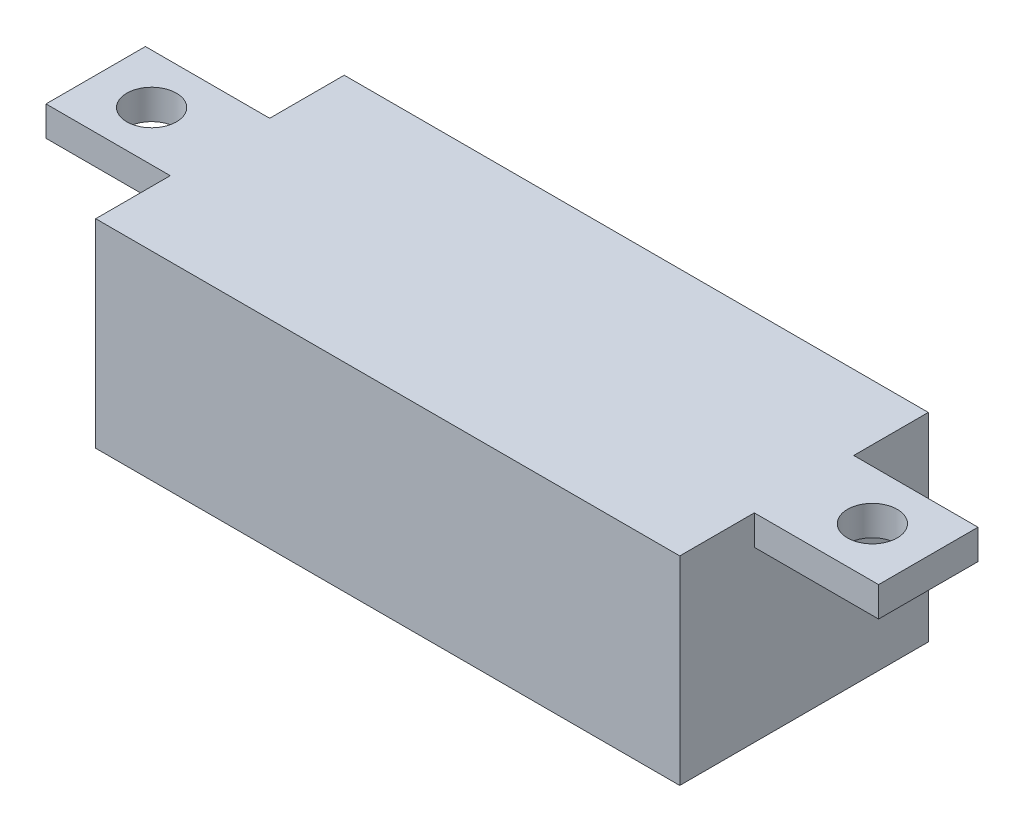
ISO-10303-21;
HEADER;
FILE_DESCRIPTION(('STEP AP214'),'2;1');
FILE_NAME('part.step','',(''),(''),'','','');
FILE_SCHEMA(('AUTOMOTIVE_DESIGN { 1 0 10303 214 1 1 1 1 }'));
ENDSEC;
DATA;
#1=APPLICATION_CONTEXT('core data for automotive mechanical design processes');
#2=APPLICATION_PROTOCOL_DEFINITION('international standard','automotive_design',2000,#1);
#3=PRODUCT_CONTEXT('',#1,'mechanical');
#4=PRODUCT('Part','Part','',(#3));
#5=PRODUCT_RELATED_PRODUCT_CATEGORY('part','',(#4));
#6=PRODUCT_DEFINITION_FORMATION('','',#4);
#7=PRODUCT_DEFINITION_CONTEXT('part definition',#1,'design');
#8=PRODUCT_DEFINITION('design','',#6,#7);
#9=PRODUCT_DEFINITION_SHAPE('','',#8);
#10=(LENGTH_UNIT() NAMED_UNIT(*) SI_UNIT(.MILLI.,.METRE.));
#11=(NAMED_UNIT(*) PLANE_ANGLE_UNIT() SI_UNIT($,.RADIAN.));
#12=(NAMED_UNIT(*) SI_UNIT($,.STERADIAN.) SOLID_ANGLE_UNIT());
#13=UNCERTAINTY_MEASURE_WITH_UNIT(LENGTH_MEASURE(1.E-05),#10,'distance_accuracy_value','');
#14=(GEOMETRIC_REPRESENTATION_CONTEXT(3) GLOBAL_UNCERTAINTY_ASSIGNED_CONTEXT((#13)) GLOBAL_UNIT_ASSIGNED_CONTEXT((#10,
#11,#12)) REPRESENTATION_CONTEXT('',''));
#15=CARTESIAN_POINT('',(0.,0.,0.));
#16=DIRECTION('',(0.,0.,1.));
#17=DIRECTION('',(1.,0.,0.));
#18=AXIS2_PLACEMENT_3D('',#15,#16,#17);
#19=CARTESIAN_POINT('',(-11.75,8.,5.));
#20=DIRECTION('',(1.,0.,0.));
#21=DIRECTION('',(0.,0.,-1.));
#22=AXIS2_PLACEMENT_3D('',#19,#20,#21);
#23=PLANE('',#22);
#24=DIRECTION('',(0.,0.,-1.));
#25=VECTOR('',#24,1.);
#26=CARTESIAN_POINT('',(-11.75,6.8,5.));
#27=LINE('',#26,#25);
#28=CARTESIAN_POINT('',(-11.75,6.8,2.));
#29=VERTEX_POINT('',#28);
#30=CARTESIAN_POINT('',(-11.75,6.8,-2.));
#31=VERTEX_POINT('',#30);
#32=EDGE_CURVE('E11',#29,#31,#27,.T.);
#33=ORIENTED_EDGE('',*,*,#32,.T.);
#34=DIRECTION('',(0.,1.,0.));
#35=VECTOR('',#34,1.);
#36=CARTESIAN_POINT('',(-11.75,8.,-2.));
#37=LINE('',#36,#35);
#38=CARTESIAN_POINT('',(-11.75,8.,-2.));
#39=VERTEX_POINT('',#38);
#40=EDGE_CURVE('E156',#31,#39,#37,.T.);
#41=ORIENTED_EDGE('',*,*,#40,.T.);
#42=DIRECTION('',(0.,0.,1.));
#43=VECTOR('',#42,1.);
#44=CARTESIAN_POINT('',(-11.75,8.,5.));
#45=LINE('',#44,#43);
#46=CARTESIAN_POINT('',(-11.75,8.,-5.));
#47=VERTEX_POINT('',#46);
#48=EDGE_CURVE('E190',#47,#39,#45,.T.);
#49=ORIENTED_EDGE('',*,*,#48,.F.);
#50=DIRECTION('',(0.,-1.,0.));
#51=VECTOR('',#50,1.);
#52=CARTESIAN_POINT('',(-11.75,8.,-5.));
#53=LINE('',#52,#51);
#54=CARTESIAN_POINT('',(-11.75,0.,-5.));
#55=VERTEX_POINT('',#54);
#56=EDGE_CURVE('E202',#47,#55,#53,.T.);
#57=ORIENTED_EDGE('',*,*,#56,.T.);
#58=DIRECTION('',(0.,0.,1.));
#59=VECTOR('',#58,1.);
#60=CARTESIAN_POINT('',(-11.75,0.,5.));
#61=LINE('',#60,#59);
#62=CARTESIAN_POINT('',(-11.75,0.,5.));
#63=VERTEX_POINT('',#62);
#64=EDGE_CURVE('E189',#55,#63,#61,.T.);
#65=ORIENTED_EDGE('',*,*,#64,.T.);
#66=DIRECTION('',(0.,-1.,0.));
#67=VECTOR('',#66,1.);
#68=CARTESIAN_POINT('',(-11.75,8.,5.));
#69=LINE('',#68,#67);
#70=CARTESIAN_POINT('',(-11.75,8.,5.));
#71=VERTEX_POINT('',#70);
#72=EDGE_CURVE('E219',#71,#63,#69,.T.);
#73=ORIENTED_EDGE('',*,*,#72,.F.);
#74=CARTESIAN_POINT('',(-11.75,8.,2.));
#75=VERTEX_POINT('',#74);
#76=EDGE_CURVE('E194',#75,#71,#45,.T.);
#77=ORIENTED_EDGE('',*,*,#76,.F.);
#78=DIRECTION('',(0.,-1.,0.));
#79=VECTOR('',#78,1.);
#80=CARTESIAN_POINT('',(-11.75,8.,2.));
#81=LINE('',#80,#79);
#82=EDGE_CURVE('E153',#75,#29,#81,.T.);
#83=ORIENTED_EDGE('',*,*,#82,.T.);
#84=EDGE_LOOP('',(#33,#41,#49,#57,#65,#73,#77,#83));
#85=FACE_BOUND('',#84,.T.);
#86=ADVANCED_FACE('F33',(#85),#23,.F.);
#87=CARTESIAN_POINT('',(11.75,8.,5.));
#88=DIRECTION('',(0.,0.,-1.));
#89=DIRECTION('',(-1.,0.,0.));
#90=AXIS2_PLACEMENT_3D('',#87,#88,#89);
#91=PLANE('',#90);
#92=DIRECTION('',(1.,0.,0.));
#93=VECTOR('',#92,1.);
#94=CARTESIAN_POINT('',(11.75,0.,5.));
#95=LINE('',#94,#93);
#96=CARTESIAN_POINT('',(11.75,0.,5.));
#97=VERTEX_POINT('',#96);
#98=EDGE_CURVE('E205',#63,#97,#95,.T.);
#99=ORIENTED_EDGE('',*,*,#98,.T.);
#100=DIRECTION('',(0.,-1.,0.));
#101=VECTOR('',#100,1.);
#102=CARTESIAN_POINT('',(11.75,8.,5.));
#103=LINE('',#102,#101);
#104=CARTESIAN_POINT('',(11.75,8.,5.));
#105=VERTEX_POINT('',#104);
#106=EDGE_CURVE('E216',#105,#97,#103,.T.);
#107=ORIENTED_EDGE('',*,*,#106,.F.);
#108=DIRECTION('',(1.,0.,0.));
#109=VECTOR('',#108,1.);
#110=CARTESIAN_POINT('',(11.75,8.,5.));
#111=LINE('',#110,#109);
#112=EDGE_CURVE('E193',#71,#105,#111,.T.);
#113=ORIENTED_EDGE('',*,*,#112,.F.);
#114=ORIENTED_EDGE('',*,*,#72,.T.);
#115=EDGE_LOOP('',(#99,#107,#113,#114));
#116=FACE_BOUND('',#115,.T.);
#117=ADVANCED_FACE('F256',(#116),#91,.F.);
#118=CARTESIAN_POINT('',(11.75,8.,5.));
#119=DIRECTION('',(-1.,0.,0.));
#120=DIRECTION('',(0.,0.,1.));
#121=AXIS2_PLACEMENT_3D('',#118,#119,#120);
#122=PLANE('',#121);
#123=DIRECTION('',(0.,0.,-1.));
#124=VECTOR('',#123,1.);
#125=CARTESIAN_POINT('',(11.75,8.,5.));
#126=LINE('',#125,#124);
#127=CARTESIAN_POINT('',(11.75,8.,-2.));
#128=VERTEX_POINT('',#127);
#129=CARTESIAN_POINT('',(11.75,8.,-5.));
#130=VERTEX_POINT('',#129);
#131=EDGE_CURVE('E196',#128,#130,#126,.T.);
#132=ORIENTED_EDGE('',*,*,#131,.F.);
#133=DIRECTION('',(0.,-1.,0.));
#134=VECTOR('',#133,1.);
#135=CARTESIAN_POINT('',(11.75,8.,-2.));
#136=LINE('',#135,#134);
#137=CARTESIAN_POINT('',(11.75,6.8,-2.));
#138=VERTEX_POINT('',#137);
#139=EDGE_CURVE('E186',#128,#138,#136,.T.);
#140=ORIENTED_EDGE('',*,*,#139,.T.);
#141=DIRECTION('',(0.,0.,-1.));
#142=VECTOR('',#141,1.);
#143=CARTESIAN_POINT('',(11.75,6.8,5.));
#144=LINE('',#143,#142);
#145=CARTESIAN_POINT('',(11.75,6.8,2.));
#146=VERTEX_POINT('',#145);
#147=EDGE_CURVE('E40',#146,#138,#144,.T.);
#148=ORIENTED_EDGE('',*,*,#147,.F.);
#149=DIRECTION('',(0.,1.,0.));
#150=VECTOR('',#149,1.);
#151=CARTESIAN_POINT('',(11.75,8.,2.));
#152=LINE('',#151,#150);
#153=CARTESIAN_POINT('',(11.75,8.,2.));
#154=VERTEX_POINT('',#153);
#155=EDGE_CURVE('E181',#146,#154,#152,.T.);
#156=ORIENTED_EDGE('',*,*,#155,.T.);
#157=EDGE_CURVE('E197',#105,#154,#126,.T.);
#158=ORIENTED_EDGE('',*,*,#157,.F.);
#159=ORIENTED_EDGE('',*,*,#106,.T.);
#160=DIRECTION('',(0.,0.,-1.));
#161=VECTOR('',#160,1.);
#162=CARTESIAN_POINT('',(11.75,0.,5.));
#163=LINE('',#162,#161);
#164=CARTESIAN_POINT('',(11.75,0.,-5.));
#165=VERTEX_POINT('',#164);
#166=EDGE_CURVE('E207',#97,#165,#163,.T.);
#167=ORIENTED_EDGE('',*,*,#166,.T.);
#168=DIRECTION('',(0.,-1.,0.));
#169=VECTOR('',#168,1.);
#170=CARTESIAN_POINT('',(11.75,8.,-5.));
#171=LINE('',#170,#169);
#172=EDGE_CURVE('E213',#130,#165,#171,.T.);
#173=ORIENTED_EDGE('',*,*,#172,.F.);
#174=EDGE_LOOP('',(#132,#140,#148,#156,#158,#159,#167,#173));
#175=FACE_BOUND('',#174,.T.);
#176=ADVANCED_FACE('F231',(#175),#122,.F.);
#177=CARTESIAN_POINT('',(11.75,8.,-5.));
#178=DIRECTION('',(0.,0.,1.));
#179=DIRECTION('',(1.,0.,0.));
#180=AXIS2_PLACEMENT_3D('',#177,#178,#179);
#181=PLANE('',#180);
#182=DIRECTION('',(-1.,0.,0.));
#183=VECTOR('',#182,1.);
#184=CARTESIAN_POINT('',(11.75,0.,-5.));
#185=LINE('',#184,#183);
#186=EDGE_CURVE('E209',#165,#55,#185,.T.);
#187=ORIENTED_EDGE('',*,*,#186,.T.);
#188=ORIENTED_EDGE('',*,*,#56,.F.);
#189=DIRECTION('',(-1.,0.,0.));
#190=VECTOR('',#189,1.);
#191=CARTESIAN_POINT('',(11.75,8.,-5.));
#192=LINE('',#191,#190);
#193=EDGE_CURVE('E200',#130,#47,#192,.T.);
#194=ORIENTED_EDGE('',*,*,#193,.F.);
#195=ORIENTED_EDGE('',*,*,#172,.T.);
#196=EDGE_LOOP('',(#187,#188,#194,#195));
#197=FACE_BOUND('',#196,.T.);
#198=ADVANCED_FACE('F239',(#197),#181,.F.);
#199=CARTESIAN_POINT('',(0.,8.,0.));
#200=DIRECTION('',(0.,1.,0.));
#201=DIRECTION('',(0.,0.,1.));
#202=AXIS2_PLACEMENT_3D('',#199,#200,#201);
#203=PLANE('',#202);
#204=ORIENTED_EDGE('',*,*,#48,.T.);
#205=DIRECTION('',(-1.,0.,0.));
#206=VECTOR('',#205,1.);
#207=CARTESIAN_POINT('',(-16.75,8.,-2.));
#208=LINE('',#207,#206);
#209=CARTESIAN_POINT('',(-16.75,8.,-2.));
#210=VERTEX_POINT('',#209);
#211=EDGE_CURVE('E141',#39,#210,#208,.T.);
#212=ORIENTED_EDGE('',*,*,#211,.T.);
#213=DIRECTION('',(0.,0.,1.));
#214=VECTOR('',#213,1.);
#215=CARTESIAN_POINT('',(-16.75,8.,2.));
#216=LINE('',#215,#214);
#217=CARTESIAN_POINT('',(-16.75,8.,2.));
#218=VERTEX_POINT('',#217);
#219=EDGE_CURVE('E149',#210,#218,#216,.T.);
#220=ORIENTED_EDGE('',*,*,#219,.T.);
#221=DIRECTION('',(1.,0.,0.));
#222=VECTOR('',#221,1.);
#223=CARTESIAN_POINT('',(-16.75,8.,2.));
#224=LINE('',#223,#222);
#225=EDGE_CURVE('E47',#218,#75,#224,.T.);
#226=ORIENTED_EDGE('',*,*,#225,.T.);
#227=ORIENTED_EDGE('',*,*,#76,.T.);
#228=ORIENTED_EDGE('',*,*,#112,.T.);
#229=ORIENTED_EDGE('',*,*,#157,.T.);
#230=DIRECTION('',(1.,0.,0.));
#231=VECTOR('',#230,1.);
#232=CARTESIAN_POINT('',(16.75,8.,2.));
#233=LINE('',#232,#231);
#234=CARTESIAN_POINT('',(16.75,8.,2.));
#235=VERTEX_POINT('',#234);
#236=EDGE_CURVE('E163',#154,#235,#233,.T.);
#237=ORIENTED_EDGE('',*,*,#236,.T.);
#238=DIRECTION('',(0.,0.,-1.));
#239=VECTOR('',#238,1.);
#240=CARTESIAN_POINT('',(16.75,8.,2.));
#241=LINE('',#240,#239);
#242=CARTESIAN_POINT('',(16.75,8.,-2.));
#243=VERTEX_POINT('',#242);
#244=EDGE_CURVE('E176',#235,#243,#241,.T.);
#245=ORIENTED_EDGE('',*,*,#244,.T.);
#246=DIRECTION('',(-1.,0.,0.));
#247=VECTOR('',#246,1.);
#248=CARTESIAN_POINT('',(16.75,8.,-2.));
#249=LINE('',#248,#247);
#250=EDGE_CURVE('E54',#243,#128,#249,.T.);
#251=ORIENTED_EDGE('',*,*,#250,.T.);
#252=ORIENTED_EDGE('',*,*,#131,.T.);
#253=ORIENTED_EDGE('',*,*,#193,.T.);
#254=EDGE_LOOP('',(#204,#212,#220,#226,#227,#228,#229,#237,#245,#251,#252,#253));
#255=FACE_BOUND('',#254,.T.);
#256=CARTESIAN_POINT('',(14.5,8.,0.));
#257=DIRECTION('',(0.,1.,0.));
#258=DIRECTION('',(0.,0.,1.));
#259=AXIS2_PLACEMENT_3D('',#256,#257,#258);
#260=CIRCLE('',#259,1.);
#261=CARTESIAN_POINT('',(14.5,8.,1.));
#262=VERTEX_POINT('',#261);
#263=EDGE_CURVE('E159',#262,#262,#260,.T.);
#264=ORIENTED_EDGE('',*,*,#263,.F.);
#265=EDGE_LOOP('',(#264));
#266=FACE_BOUND('',#265,.T.);
#267=CARTESIAN_POINT('',(-14.5,8.,0.));
#268=DIRECTION('',(0.,1.,0.));
#269=DIRECTION('',(0.,0.,-1.));
#270=AXIS2_PLACEMENT_3D('',#267,#268,#269);
#271=CIRCLE('',#270,1.);
#272=CARTESIAN_POINT('',(-14.5,8.,-1.));
#273=VERTEX_POINT('',#272);
#274=EDGE_CURVE('E145',#273,#273,#271,.T.);
#275=ORIENTED_EDGE('',*,*,#274,.F.);
#276=EDGE_LOOP('',(#275));
#277=FACE_BOUND('',#276,.T.);
#278=ADVANCED_FACE('F234',(#255,#266,#277),#203,.T.);
#279=CARTESIAN_POINT('',(0.,0.,0.));
#280=DIRECTION('',(0.,1.,0.));
#281=DIRECTION('',(0.,0.,1.));
#282=AXIS2_PLACEMENT_3D('',#279,#280,#281);
#283=PLANE('',#282);
#284=ORIENTED_EDGE('',*,*,#64,.F.);
#285=ORIENTED_EDGE('',*,*,#186,.F.);
#286=ORIENTED_EDGE('',*,*,#166,.F.);
#287=ORIENTED_EDGE('',*,*,#98,.F.);
#288=EDGE_LOOP('',(#284,#285,#286,#287));
#289=FACE_BOUND('',#288,.T.);
#290=ADVANCED_FACE('F268',(#289),#283,.F.);
#291=CARTESIAN_POINT('',(0.,6.8,0.));
#292=DIRECTION('',(0.,1.,0.));
#293=DIRECTION('',(0.,0.,1.));
#294=AXIS2_PLACEMENT_3D('',#291,#292,#293);
#295=PLANE('',#294);
#296=CARTESIAN_POINT('',(14.5,6.8,0.));
#297=DIRECTION('',(0.,1.,0.));
#298=DIRECTION('',(0.,0.,1.));
#299=AXIS2_PLACEMENT_3D('',#296,#297,#298);
#300=CIRCLE('',#299,1.);
#301=CARTESIAN_POINT('',(14.5,6.8,1.));
#302=VERTEX_POINT('',#301);
#303=EDGE_CURVE('E160',#302,#302,#300,.T.);
#304=ORIENTED_EDGE('',*,*,#303,.T.);
#305=EDGE_LOOP('',(#304));
#306=FACE_BOUND('',#305,.T.);
#307=DIRECTION('',(1.,0.,0.));
#308=VECTOR('',#307,1.);
#309=CARTESIAN_POINT('',(16.75,6.8,2.));
#310=LINE('',#309,#308);
#311=CARTESIAN_POINT('',(16.75,6.8,2.));
#312=VERTEX_POINT('',#311);
#313=EDGE_CURVE('E166',#146,#312,#310,.T.);
#314=ORIENTED_EDGE('',*,*,#313,.F.);
#315=ORIENTED_EDGE('',*,*,#147,.T.);
#316=DIRECTION('',(-1.,0.,0.));
#317=VECTOR('',#316,1.);
#318=CARTESIAN_POINT('',(16.75,6.8,-2.));
#319=LINE('',#318,#317);
#320=CARTESIAN_POINT('',(16.75,6.8,-2.));
#321=VERTEX_POINT('',#320);
#322=EDGE_CURVE('E171',#321,#138,#319,.T.);
#323=ORIENTED_EDGE('',*,*,#322,.F.);
#324=DIRECTION('',(0.,0.,-1.));
#325=VECTOR('',#324,1.);
#326=CARTESIAN_POINT('',(16.75,6.8,2.));
#327=LINE('',#326,#325);
#328=EDGE_CURVE('E168',#312,#321,#327,.T.);
#329=ORIENTED_EDGE('',*,*,#328,.F.);
#330=EDGE_LOOP('',(#314,#315,#323,#329));
#331=FACE_BOUND('',#330,.T.);
#332=ADVANCED_FACE('F225',(#306,#331),#295,.F.);
#333=CARTESIAN_POINT('',(16.75,6.8,-2.));
#334=DIRECTION('',(0.,0.,-1.));
#335=DIRECTION('',(-1.,0.,0.));
#336=AXIS2_PLACEMENT_3D('',#333,#334,#335);
#337=PLANE('',#336);
#338=ORIENTED_EDGE('',*,*,#139,.F.);
#339=ORIENTED_EDGE('',*,*,#250,.F.);
#340=DIRECTION('',(0.,1.,0.));
#341=VECTOR('',#340,1.);
#342=CARTESIAN_POINT('',(16.75,6.8,-2.));
#343=LINE('',#342,#341);
#344=EDGE_CURVE('E179',#321,#243,#343,.T.);
#345=ORIENTED_EDGE('',*,*,#344,.F.);
#346=ORIENTED_EDGE('',*,*,#322,.T.);
#347=EDGE_LOOP('',(#338,#339,#345,#346));
#348=FACE_BOUND('',#347,.T.);
#349=ADVANCED_FACE('F229',(#348),#337,.T.);
#350=CARTESIAN_POINT('',(16.75,6.8,2.));
#351=DIRECTION('',(0.,0.,1.));
#352=DIRECTION('',(1.,0.,0.));
#353=AXIS2_PLACEMENT_3D('',#350,#351,#352);
#354=PLANE('',#353);
#355=ORIENTED_EDGE('',*,*,#155,.F.);
#356=ORIENTED_EDGE('',*,*,#313,.T.);
#357=DIRECTION('',(0.,1.,0.));
#358=VECTOR('',#357,1.);
#359=CARTESIAN_POINT('',(16.75,6.8,2.));
#360=LINE('',#359,#358);
#361=EDGE_CURVE('E174',#312,#235,#360,.T.);
#362=ORIENTED_EDGE('',*,*,#361,.T.);
#363=ORIENTED_EDGE('',*,*,#236,.F.);
#364=EDGE_LOOP('',(#355,#356,#362,#363));
#365=FACE_BOUND('',#364,.T.);
#366=ADVANCED_FACE('F274',(#365),#354,.T.);
#367=CARTESIAN_POINT('',(16.75,6.8,2.));
#368=DIRECTION('',(1.,0.,0.));
#369=DIRECTION('',(0.,0.,-1.));
#370=AXIS2_PLACEMENT_3D('',#367,#368,#369);
#371=PLANE('',#370);
#372=ORIENTED_EDGE('',*,*,#244,.F.);
#373=ORIENTED_EDGE('',*,*,#361,.F.);
#374=ORIENTED_EDGE('',*,*,#328,.T.);
#375=ORIENTED_EDGE('',*,*,#344,.T.);
#376=EDGE_LOOP('',(#372,#373,#374,#375));
#377=FACE_BOUND('',#376,.T.);
#378=ADVANCED_FACE('F277',(#377),#371,.T.);
#379=CARTESIAN_POINT('',(14.5,6.8,0.));
#380=DIRECTION('',(0.,1.,0.));
#381=DIRECTION('',(0.,0.,1.));
#382=AXIS2_PLACEMENT_3D('',#379,#380,#381);
#383=CYLINDRICAL_SURFACE('',#382,1.);
#384=ORIENTED_EDGE('',*,*,#303,.F.);
#385=EDGE_LOOP('',(#384));
#386=FACE_BOUND('',#385,.T.);
#387=ORIENTED_EDGE('',*,*,#263,.T.);
#388=EDGE_LOOP('',(#387));
#389=FACE_BOUND('',#388,.T.);
#390=ADVANCED_FACE('F252',(#386,#389),#383,.F.);
#391=CARTESIAN_POINT('',(0.,6.8,0.));
#392=DIRECTION('',(0.,-1.,0.));
#393=DIRECTION('',(0.,0.,-1.));
#394=AXIS2_PLACEMENT_3D('',#391,#392,#393);
#395=PLANE('',#394);
#396=CARTESIAN_POINT('',(-14.5,6.8,0.));
#397=DIRECTION('',(0.,1.,0.));
#398=DIRECTION('',(0.,0.,-1.));
#399=AXIS2_PLACEMENT_3D('',#396,#397,#398);
#400=CIRCLE('',#399,1.);
#401=CARTESIAN_POINT('',(-14.5,6.8,-1.));
#402=VERTEX_POINT('',#401);
#403=EDGE_CURVE('E151',#402,#402,#400,.T.);
#404=ORIENTED_EDGE('',*,*,#403,.T.);
#405=EDGE_LOOP('',(#404));
#406=FACE_BOUND('',#405,.T.);
#407=ORIENTED_EDGE('',*,*,#32,.F.);
#408=DIRECTION('',(1.,0.,0.));
#409=VECTOR('',#408,1.);
#410=CARTESIAN_POINT('',(-16.75,6.8,2.));
#411=LINE('',#410,#409);
#412=CARTESIAN_POINT('',(-16.75,6.8,2.));
#413=VERTEX_POINT('',#412);
#414=EDGE_CURVE('E124',#413,#29,#411,.T.);
#415=ORIENTED_EDGE('',*,*,#414,.F.);
#416=DIRECTION('',(0.,0.,1.));
#417=VECTOR('',#416,1.);
#418=CARTESIAN_POINT('',(-16.75,6.8,2.));
#419=LINE('',#418,#417);
#420=CARTESIAN_POINT('',(-16.75,6.8,-2.));
#421=VERTEX_POINT('',#420);
#422=EDGE_CURVE('E136',#421,#413,#419,.T.);
#423=ORIENTED_EDGE('',*,*,#422,.F.);
#424=DIRECTION('',(-1.,0.,0.));
#425=VECTOR('',#424,1.);
#426=CARTESIAN_POINT('',(-16.75,6.8,-2.));
#427=LINE('',#426,#425);
#428=EDGE_CURVE('E130',#31,#421,#427,.T.);
#429=ORIENTED_EDGE('',*,*,#428,.F.);
#430=EDGE_LOOP('',(#407,#415,#423,#429));
#431=FACE_BOUND('',#430,.T.);
#432=ADVANCED_FACE('F134',(#406,#431),#395,.T.);
#433=CARTESIAN_POINT('',(-16.75,6.8,-2.));
#434=DIRECTION('',(0.,0.,-1.));
#435=DIRECTION('',(-1.,0.,0.));
#436=AXIS2_PLACEMENT_3D('',#433,#434,#435);
#437=PLANE('',#436);
#438=ORIENTED_EDGE('',*,*,#40,.F.);
#439=ORIENTED_EDGE('',*,*,#428,.T.);
#440=DIRECTION('',(0.,1.,0.));
#441=VECTOR('',#440,1.);
#442=CARTESIAN_POINT('',(-16.75,6.8,-2.));
#443=LINE('',#442,#441);
#444=EDGE_CURVE('E129',#421,#210,#443,.T.);
#445=ORIENTED_EDGE('',*,*,#444,.T.);
#446=ORIENTED_EDGE('',*,*,#211,.F.);
#447=EDGE_LOOP('',(#438,#439,#445,#446));
#448=FACE_BOUND('',#447,.T.);
#449=ADVANCED_FACE('F244',(#448),#437,.T.);
#450=CARTESIAN_POINT('',(-16.75,6.8,2.));
#451=DIRECTION('',(0.,0.,1.));
#452=DIRECTION('',(1.,0.,0.));
#453=AXIS2_PLACEMENT_3D('',#450,#451,#452);
#454=PLANE('',#453);
#455=ORIENTED_EDGE('',*,*,#82,.F.);
#456=ORIENTED_EDGE('',*,*,#225,.F.);
#457=DIRECTION('',(0.,1.,0.));
#458=VECTOR('',#457,1.);
#459=CARTESIAN_POINT('',(-16.75,6.8,2.));
#460=LINE('',#459,#458);
#461=EDGE_CURVE('E121',#413,#218,#460,.T.);
#462=ORIENTED_EDGE('',*,*,#461,.F.);
#463=ORIENTED_EDGE('',*,*,#414,.T.);
#464=EDGE_LOOP('',(#455,#456,#462,#463));
#465=FACE_BOUND('',#464,.T.);
#466=ADVANCED_FACE('F123',(#465),#454,.T.);
#467=CARTESIAN_POINT('',(-16.75,6.8,2.));
#468=DIRECTION('',(-1.,0.,0.));
#469=DIRECTION('',(0.,0.,1.));
#470=AXIS2_PLACEMENT_3D('',#467,#468,#469);
#471=PLANE('',#470);
#472=ORIENTED_EDGE('',*,*,#219,.F.);
#473=ORIENTED_EDGE('',*,*,#444,.F.);
#474=ORIENTED_EDGE('',*,*,#422,.T.);
#475=ORIENTED_EDGE('',*,*,#461,.T.);
#476=EDGE_LOOP('',(#472,#473,#474,#475));
#477=FACE_BOUND('',#476,.T.);
#478=ADVANCED_FACE('F139',(#477),#471,.T.);
#479=CARTESIAN_POINT('',(-14.5,6.8,0.));
#480=DIRECTION('',(0.,1.,0.));
#481=DIRECTION('',(0.,0.,1.));
#482=AXIS2_PLACEMENT_3D('',#479,#480,#481);
#483=CYLINDRICAL_SURFACE('',#482,1.);
#484=ORIENTED_EDGE('',*,*,#403,.F.);
#485=EDGE_LOOP('',(#484));
#486=FACE_BOUND('',#485,.T.);
#487=ORIENTED_EDGE('',*,*,#274,.T.);
#488=EDGE_LOOP('',(#487));
#489=FACE_BOUND('',#488,.T.);
#490=ADVANCED_FACE('F291',(#486,#489),#483,.F.);
#491=CLOSED_SHELL('',(#86,#117,#176,#198,#278,#290,#332,#349,#366,#378,#390,#432,#449,#466,#478,#490));
#492=MANIFOLD_SOLID_BREP('B2',#491);
#493=ADVANCED_BREP_SHAPE_REPRESENTATION('',(#18,#492),#14);
#494=SHAPE_DEFINITION_REPRESENTATION(#9,#493);
ENDSEC;
END-ISO-10303-21;
